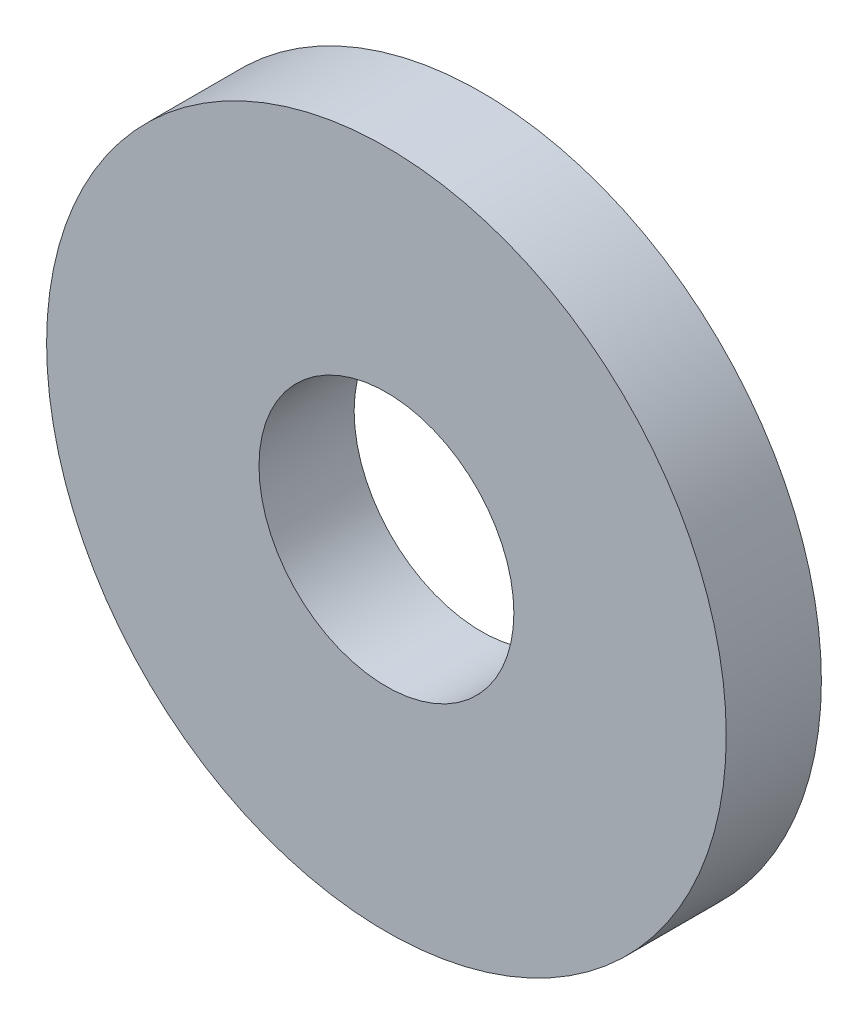
ISO-10303-21;
HEADER;
FILE_DESCRIPTION(('STEP AP214'),'2;1');
FILE_NAME('part.step','',(''),(''),'','','');
FILE_SCHEMA(('AUTOMOTIVE_DESIGN { 1 0 10303 214 1 1 1 1 }'));
ENDSEC;
DATA;
#1=APPLICATION_CONTEXT('core data for automotive mechanical design processes');
#2=APPLICATION_PROTOCOL_DEFINITION('international standard','automotive_design',2000,#1);
#3=PRODUCT_CONTEXT('',#1,'mechanical');
#4=PRODUCT('Part','Part','',(#3));
#5=PRODUCT_RELATED_PRODUCT_CATEGORY('part','',(#4));
#6=PRODUCT_DEFINITION_FORMATION('','',#4);
#7=PRODUCT_DEFINITION_CONTEXT('part definition',#1,'design');
#8=PRODUCT_DEFINITION('design','',#6,#7);
#9=PRODUCT_DEFINITION_SHAPE('','',#8);
#10=(LENGTH_UNIT() NAMED_UNIT(*) SI_UNIT(.MILLI.,.METRE.));
#11=(NAMED_UNIT(*) PLANE_ANGLE_UNIT() SI_UNIT($,.RADIAN.));
#12=(NAMED_UNIT(*) SI_UNIT($,.STERADIAN.) SOLID_ANGLE_UNIT());
#13=UNCERTAINTY_MEASURE_WITH_UNIT(LENGTH_MEASURE(1.E-05),#10,'distance_accuracy_value','');
#14=(GEOMETRIC_REPRESENTATION_CONTEXT(3) GLOBAL_UNCERTAINTY_ASSIGNED_CONTEXT((#13)) GLOBAL_UNIT_ASSIGNED_CONTEXT((#10,
#11,#12)) REPRESENTATION_CONTEXT('',''));
#15=CARTESIAN_POINT('',(0.,0.,0.));
#16=DIRECTION('',(0.,0.,1.));
#17=DIRECTION('',(1.,0.,0.));
#18=AXIS2_PLACEMENT_3D('',#15,#16,#17);
#19=CARTESIAN_POINT('',(0.,0.,0.));
#20=DIRECTION('',(0.,0.,1.));
#21=DIRECTION('',(1.,0.,0.));
#22=AXIS2_PLACEMENT_3D('',#19,#20,#21);
#23=PLANE('',#22);
#24=CARTESIAN_POINT('',(0.,0.,0.));
#25=DIRECTION('',(0.,0.,1.));
#26=DIRECTION('',(1.,0.,0.));
#27=AXIS2_PLACEMENT_3D('',#24,#25,#26);
#28=CIRCLE('',#27,4.7625);
#29=CARTESIAN_POINT('',(4.7625,0.,0.));
#30=VERTEX_POINT('',#29);
#31=EDGE_CURVE('E26',#30,#30,#28,.F.);
#32=ORIENTED_EDGE('',*,*,#31,.T.);
#33=EDGE_LOOP('',(#32));
#34=FACE_BOUND('',#33,.T.);
#35=CARTESIAN_POINT('',(0.,0.,0.));
#36=DIRECTION('',(0.,0.,1.));
#37=DIRECTION('',(1.,0.,0.));
#38=AXIS2_PLACEMENT_3D('',#35,#36,#37);
#39=CIRCLE('',#38,12.7);
#40=CARTESIAN_POINT('',(12.7,0.,0.));
#41=VERTEX_POINT('',#40);
#42=EDGE_CURVE('E17',#41,#41,#39,.F.);
#43=ORIENTED_EDGE('',*,*,#42,.F.);
#44=EDGE_LOOP('',(#43));
#45=FACE_BOUND('',#44,.T.);
#46=ADVANCED_FACE('F14',(#34,#45),#23,.T.);
#47=CARTESIAN_POINT('',(0.,0.,-3.556));
#48=DIRECTION('',(0.,0.,1.));
#49=DIRECTION('',(1.,0.,0.));
#50=AXIS2_PLACEMENT_3D('',#47,#48,#49);
#51=CYLINDRICAL_SURFACE('',#50,12.7);
#52=ORIENTED_EDGE('',*,*,#42,.T.);
#53=EDGE_LOOP('',(#52));
#54=FACE_BOUND('',#53,.T.);
#55=CARTESIAN_POINT('',(0.,0.,-3.556));
#56=DIRECTION('',(0.,0.,1.));
#57=DIRECTION('',(1.,0.,0.));
#58=AXIS2_PLACEMENT_3D('',#55,#56,#57);
#59=CIRCLE('',#58,12.7);
#60=CARTESIAN_POINT('',(12.7,0.,-3.556));
#61=VERTEX_POINT('',#60);
#62=EDGE_CURVE('E21',#61,#61,#59,.T.);
#63=ORIENTED_EDGE('',*,*,#62,.T.);
#64=EDGE_LOOP('',(#63));
#65=FACE_BOUND('',#64,.T.);
#66=ADVANCED_FACE('F34',(#54,#65),#51,.T.);
#67=CARTESIAN_POINT('',(0.,0.,-3.556));
#68=DIRECTION('',(0.,0.,1.));
#69=DIRECTION('',(1.,0.,0.));
#70=AXIS2_PLACEMENT_3D('',#67,#68,#69);
#71=CYLINDRICAL_SURFACE('',#70,4.7625);
#72=ORIENTED_EDGE('',*,*,#31,.F.);
#73=EDGE_LOOP('',(#72));
#74=FACE_BOUND('',#73,.T.);
#75=CARTESIAN_POINT('',(0.,0.,-3.556));
#76=DIRECTION('',(0.,0.,1.));
#77=DIRECTION('',(1.,0.,0.));
#78=AXIS2_PLACEMENT_3D('',#75,#76,#77);
#79=CIRCLE('',#78,4.7625);
#80=CARTESIAN_POINT('',(4.7625,0.,-3.556));
#81=VERTEX_POINT('',#80);
#82=EDGE_CURVE('E10',#81,#81,#79,.F.);
#83=ORIENTED_EDGE('',*,*,#82,.T.);
#84=EDGE_LOOP('',(#83));
#85=FACE_BOUND('',#84,.T.);
#86=ADVANCED_FACE('F42',(#74,#85),#71,.F.);
#87=CARTESIAN_POINT('',(0.,0.,-3.556));
#88=DIRECTION('',(0.,0.,1.));
#89=DIRECTION('',(1.,0.,0.));
#90=AXIS2_PLACEMENT_3D('',#87,#88,#89);
#91=PLANE('',#90);
#92=ORIENTED_EDGE('',*,*,#82,.F.);
#93=EDGE_LOOP('',(#92));
#94=FACE_BOUND('',#93,.T.);
#95=ORIENTED_EDGE('',*,*,#62,.F.);
#96=EDGE_LOOP('',(#95));
#97=FACE_BOUND('',#96,.T.);
#98=ADVANCED_FACE('F43',(#94,#97),#91,.F.);
#99=CLOSED_SHELL('',(#46,#66,#86,#98));
#100=MANIFOLD_SOLID_BREP('B1',#99);
#101=ADVANCED_BREP_SHAPE_REPRESENTATION('',(#18,#100),#14);
#102=SHAPE_DEFINITION_REPRESENTATION(#9,#101);
ENDSEC;
END-ISO-10303-21;
